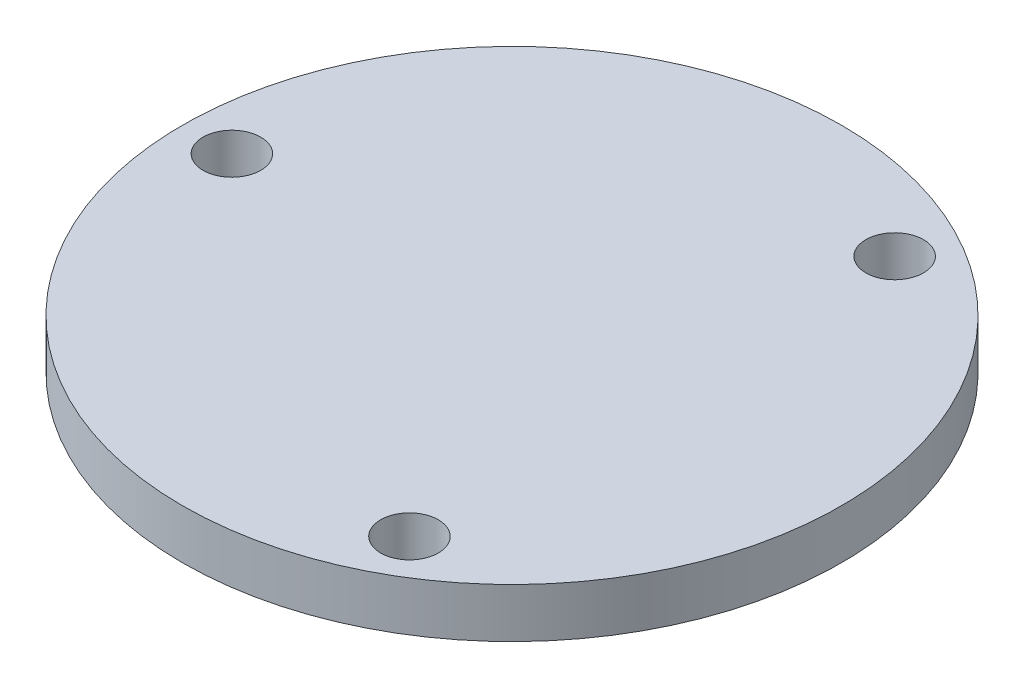
ISO-10303-21;
HEADER;
FILE_DESCRIPTION(('STEP AP214'),'2;1');
FILE_NAME('part.step','',(''),(''),'','','');
FILE_SCHEMA(('AUTOMOTIVE_DESIGN { 1 0 10303 214 1 1 1 1 }'));
ENDSEC;
DATA;
#1=APPLICATION_CONTEXT('core data for automotive mechanical design processes');
#2=APPLICATION_PROTOCOL_DEFINITION('international standard','automotive_design',2000,#1);
#3=PRODUCT_CONTEXT('',#1,'mechanical');
#4=PRODUCT('Part','Part','',(#3));
#5=PRODUCT_RELATED_PRODUCT_CATEGORY('part','',(#4));
#6=PRODUCT_DEFINITION_FORMATION('','',#4);
#7=PRODUCT_DEFINITION_CONTEXT('part definition',#1,'design');
#8=PRODUCT_DEFINITION('design','',#6,#7);
#9=PRODUCT_DEFINITION_SHAPE('','',#8);
#10=(LENGTH_UNIT() NAMED_UNIT(*) SI_UNIT(.MILLI.,.METRE.));
#11=(NAMED_UNIT(*) PLANE_ANGLE_UNIT() SI_UNIT($,.RADIAN.));
#12=(NAMED_UNIT(*) SI_UNIT($,.STERADIAN.) SOLID_ANGLE_UNIT());
#13=UNCERTAINTY_MEASURE_WITH_UNIT(LENGTH_MEASURE(1.E-05),#10,'distance_accuracy_value','');
#14=(GEOMETRIC_REPRESENTATION_CONTEXT(3) GLOBAL_UNCERTAINTY_ASSIGNED_CONTEXT((#13)) GLOBAL_UNIT_ASSIGNED_CONTEXT((#10,
#11,#12)) REPRESENTATION_CONTEXT('',''));
#15=CARTESIAN_POINT('',(0.,0.,0.));
#16=DIRECTION('',(0.,0.,1.));
#17=DIRECTION('',(1.,0.,0.));
#18=AXIS2_PLACEMENT_3D('',#15,#16,#17);
#19=CARTESIAN_POINT('',(-34.1432255553676,-11.,5.12970783045502));
#20=DIRECTION('',(0.,1.,0.));
#21=DIRECTION('',(0.,0.,1.));
#22=AXIS2_PLACEMENT_3D('',#19,#20,#21);
#23=CYLINDRICAL_SURFACE('',#22,20.);
#24=CARTESIAN_POINT('',(-34.1432255553676,-11.,5.12970783045502));
#25=DIRECTION('',(0.,-1.,0.));
#26=DIRECTION('',(0.,0.,-1.));
#27=AXIS2_PLACEMENT_3D('',#24,#25,#26);
#28=CIRCLE('',#27,20.);
#29=CARTESIAN_POINT('',(-34.1432255553676,-11.,-14.870292169545));
#30=VERTEX_POINT('',#29);
#31=EDGE_CURVE('E10',#30,#30,#28,.T.);
#32=ORIENTED_EDGE('',*,*,#31,.F.);
#33=EDGE_LOOP('',(#32));
#34=FACE_BOUND('',#33,.T.);
#35=CARTESIAN_POINT('',(-34.1432255553676,-8.,5.12970783045502));
#36=DIRECTION('',(0.,-1.,0.));
#37=DIRECTION('',(0.,0.,-1.));
#38=AXIS2_PLACEMENT_3D('',#35,#36,#37);
#39=CIRCLE('',#38,20.);
#40=CARTESIAN_POINT('',(-34.1432255553676,-8.,-14.870292169545));
#41=VERTEX_POINT('',#40);
#42=EDGE_CURVE('E34',#41,#41,#39,.T.);
#43=ORIENTED_EDGE('',*,*,#42,.T.);
#44=EDGE_LOOP('',(#43));
#45=FACE_BOUND('',#44,.T.);
#46=ADVANCED_FACE('F31',(#34,#45),#23,.T.);
#47=CARTESIAN_POINT('',(-34.1432255553676,-11.,5.12970783045502));
#48=DIRECTION('',(0.,-1.,0.));
#49=DIRECTION('',(0.,0.,-1.));
#50=AXIS2_PLACEMENT_3D('',#47,#48,#49);
#51=PLANE('',#50);
#52=CARTESIAN_POINT('',(-25.6432255553676,-11.,-9.59272403388045));
#53=DIRECTION('',(0.,-1.,0.));
#54=DIRECTION('',(0.,0.,-1.));
#55=AXIS2_PLACEMENT_3D('',#52,#53,#54);
#56=CIRCLE('',#55,1.75000000000001);
#57=CARTESIAN_POINT('',(-25.6432255553676,-11.,-11.3427240338805));
#58=VERTEX_POINT('',#57);
#59=EDGE_CURVE('E57',#58,#58,#56,.T.);
#60=ORIENTED_EDGE('',*,*,#59,.F.);
#61=EDGE_LOOP('',(#60));
#62=FACE_BOUND('',#61,.T.);
#63=CARTESIAN_POINT('',(-25.6432255553676,-11.,19.8521396947905));
#64=DIRECTION('',(0.,-1.,0.));
#65=DIRECTION('',(0.,0.,-1.));
#66=AXIS2_PLACEMENT_3D('',#63,#64,#65);
#67=CIRCLE('',#66,1.75);
#68=CARTESIAN_POINT('',(-25.6432255553676,-11.,18.1021396947905));
#69=VERTEX_POINT('',#68);
#70=EDGE_CURVE('E51',#69,#69,#67,.T.);
#71=ORIENTED_EDGE('',*,*,#70,.F.);
#72=EDGE_LOOP('',(#71));
#73=FACE_BOUND('',#72,.T.);
#74=CARTESIAN_POINT('',(-51.1432255553676,-11.,5.12970783045502));
#75=DIRECTION('',(0.,-1.,0.));
#76=DIRECTION('',(0.,0.,-1.));
#77=AXIS2_PLACEMENT_3D('',#74,#75,#76);
#78=CIRCLE('',#77,1.75);
#79=CARTESIAN_POINT('',(-51.1432255553676,-11.,3.37970783045502));
#80=VERTEX_POINT('',#79);
#81=EDGE_CURVE('E45',#80,#80,#78,.T.);
#82=ORIENTED_EDGE('',*,*,#81,.F.);
#83=EDGE_LOOP('',(#82));
#84=FACE_BOUND('',#83,.T.);
#85=ORIENTED_EDGE('',*,*,#31,.T.);
#86=EDGE_LOOP('',(#85));
#87=FACE_BOUND('',#86,.T.);
#88=ADVANCED_FACE('F64',(#62,#73,#84,#87),#51,.T.);
#89=CARTESIAN_POINT('',(-34.1432255553676,-8.,5.12970783045502));
#90=DIRECTION('',(0.,-1.,0.));
#91=DIRECTION('',(0.,0.,-1.));
#92=AXIS2_PLACEMENT_3D('',#89,#90,#91);
#93=PLANE('',#92);
#94=CARTESIAN_POINT('',(-25.6432255553676,-8.,-9.59272403388045));
#95=DIRECTION('',(0.,-1.,0.));
#96=DIRECTION('',(0.,0.,-1.));
#97=AXIS2_PLACEMENT_3D('',#94,#95,#96);
#98=CIRCLE('',#97,1.75000000000001);
#99=CARTESIAN_POINT('',(-25.6432255553676,-8.,-11.3427240338805));
#100=VERTEX_POINT('',#99);
#101=EDGE_CURVE('E54',#100,#100,#98,.F.);
#102=ORIENTED_EDGE('',*,*,#101,.F.);
#103=EDGE_LOOP('',(#102));
#104=FACE_BOUND('',#103,.T.);
#105=CARTESIAN_POINT('',(-25.6432255553676,-8.,19.8521396947905));
#106=DIRECTION('',(0.,-1.,0.));
#107=DIRECTION('',(0.,0.,-1.));
#108=AXIS2_PLACEMENT_3D('',#105,#106,#107);
#109=CIRCLE('',#108,1.75);
#110=CARTESIAN_POINT('',(-25.6432255553676,-8.,18.1021396947905));
#111=VERTEX_POINT('',#110);
#112=EDGE_CURVE('E48',#111,#111,#109,.F.);
#113=ORIENTED_EDGE('',*,*,#112,.F.);
#114=EDGE_LOOP('',(#113));
#115=FACE_BOUND('',#114,.T.);
#116=CARTESIAN_POINT('',(-51.1432255553676,-8.,5.12970783045502));
#117=DIRECTION('',(0.,-1.,0.));
#118=DIRECTION('',(0.,0.,-1.));
#119=AXIS2_PLACEMENT_3D('',#116,#117,#118);
#120=CIRCLE('',#119,1.75);
#121=CARTESIAN_POINT('',(-51.1432255553676,-8.,3.37970783045502));
#122=VERTEX_POINT('',#121);
#123=EDGE_CURVE('E41',#122,#122,#120,.F.);
#124=ORIENTED_EDGE('',*,*,#123,.F.);
#125=EDGE_LOOP('',(#124));
#126=FACE_BOUND('',#125,.T.);
#127=ORIENTED_EDGE('',*,*,#42,.F.);
#128=EDGE_LOOP('',(#127));
#129=FACE_BOUND('',#128,.T.);
#130=ADVANCED_FACE('F67',(#104,#115,#126,#129),#93,.F.);
#131=CARTESIAN_POINT('',(-51.1432255553676,-7.999,5.12970783045502));
#132=DIRECTION('',(0.,-1.,0.));
#133=DIRECTION('',(0.,0.,-1.));
#134=AXIS2_PLACEMENT_3D('',#131,#132,#133);
#135=CYLINDRICAL_SURFACE('',#134,1.75);
#136=ORIENTED_EDGE('',*,*,#81,.T.);
#137=EDGE_LOOP('',(#136));
#138=FACE_BOUND('',#137,.T.);
#139=ORIENTED_EDGE('',*,*,#123,.T.);
#140=EDGE_LOOP('',(#139));
#141=FACE_BOUND('',#140,.T.);
#142=ADVANCED_FACE('F73',(#138,#141),#135,.F.);
#143=CARTESIAN_POINT('',(-25.6432255553676,-7.999,19.8521396947905));
#144=DIRECTION('',(0.,-1.,0.));
#145=DIRECTION('',(0.,0.,-1.));
#146=AXIS2_PLACEMENT_3D('',#143,#144,#145);
#147=CYLINDRICAL_SURFACE('',#146,1.75);
#148=ORIENTED_EDGE('',*,*,#70,.T.);
#149=EDGE_LOOP('',(#148));
#150=FACE_BOUND('',#149,.T.);
#151=ORIENTED_EDGE('',*,*,#112,.T.);
#152=EDGE_LOOP('',(#151));
#153=FACE_BOUND('',#152,.T.);
#154=ADVANCED_FACE('F76',(#150,#153),#147,.F.);
#155=CARTESIAN_POINT('',(-25.6432255553676,-7.999,-9.59272403388045));
#156=DIRECTION('',(0.,-1.,0.));
#157=DIRECTION('',(0.,0.,-1.));
#158=AXIS2_PLACEMENT_3D('',#155,#156,#157);
#159=CYLINDRICAL_SURFACE('',#158,1.75000000000001);
#160=ORIENTED_EDGE('',*,*,#59,.T.);
#161=EDGE_LOOP('',(#160));
#162=FACE_BOUND('',#161,.T.);
#163=ORIENTED_EDGE('',*,*,#101,.T.);
#164=EDGE_LOOP('',(#163));
#165=FACE_BOUND('',#164,.T.);
#166=ADVANCED_FACE('F61',(#162,#165),#159,.F.);
#167=CLOSED_SHELL('',(#46,#88,#130,#142,#154,#166));
#168=MANIFOLD_SOLID_BREP('B2',#167);
#169=ADVANCED_BREP_SHAPE_REPRESENTATION('',(#18,#168),#14);
#170=SHAPE_DEFINITION_REPRESENTATION(#9,#169);
ENDSEC;
END-ISO-10303-21;
